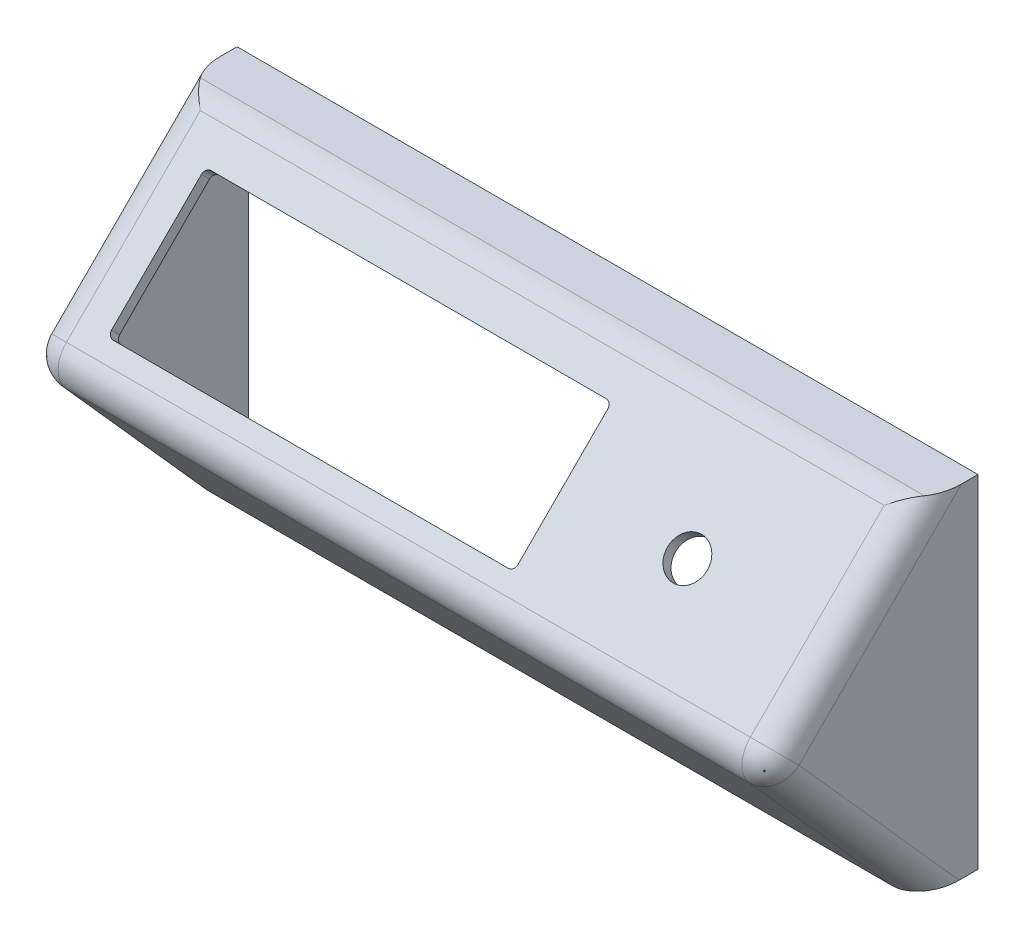
ISO-10303-21;
HEADER;
FILE_DESCRIPTION(('STEP AP214'),'2;1');
FILE_NAME('part.step','',(''),(''),'','','');
FILE_SCHEMA(('AUTOMOTIVE_DESIGN { 1 0 10303 214 1 1 1 1 }'));
ENDSEC;
DATA;
#1=APPLICATION_CONTEXT('core data for automotive mechanical design processes');
#2=APPLICATION_PROTOCOL_DEFINITION('international standard','automotive_design',2000,#1);
#3=PRODUCT_CONTEXT('',#1,'mechanical');
#4=PRODUCT('Part','Part','',(#3));
#5=PRODUCT_RELATED_PRODUCT_CATEGORY('part','',(#4));
#6=PRODUCT_DEFINITION_FORMATION('','',#4);
#7=PRODUCT_DEFINITION_CONTEXT('part definition',#1,'design');
#8=PRODUCT_DEFINITION('design','',#6,#7);
#9=PRODUCT_DEFINITION_SHAPE('','',#8);
#10=(LENGTH_UNIT() NAMED_UNIT(*) SI_UNIT(.MILLI.,.METRE.));
#11=(NAMED_UNIT(*) PLANE_ANGLE_UNIT() SI_UNIT($,.RADIAN.));
#12=(NAMED_UNIT(*) SI_UNIT($,.STERADIAN.) SOLID_ANGLE_UNIT());
#13=UNCERTAINTY_MEASURE_WITH_UNIT(LENGTH_MEASURE(1.E-05),#10,'distance_accuracy_value','');
#14=(GEOMETRIC_REPRESENTATION_CONTEXT(3) GLOBAL_UNCERTAINTY_ASSIGNED_CONTEXT((#13)) GLOBAL_UNIT_ASSIGNED_CONTEXT((#10,
#11,#12)) REPRESENTATION_CONTEXT('',''));
#15=CARTESIAN_POINT('',(0.,0.,0.));
#16=DIRECTION('',(0.,0.,1.));
#17=DIRECTION('',(1.,0.,0.));
#18=AXIS2_PLACEMENT_3D('',#15,#16,#17);
#19=CARTESIAN_POINT('',(65.,60.,-9.99999999999999));
#20=DIRECTION('',(0.,0.,1.));
#21=DIRECTION('',(0.,-1.,0.));
#22=AXIS2_PLACEMENT_3D('',#19,#20,#21);
#23=PLANE('',#22);
#24=DIRECTION('',(0.,1.,0.));
#25=VECTOR('',#24,1.);
#26=CARTESIAN_POINT('',(-65.,60.,-9.99999999999999));
#27=LINE('',#26,#25);
#28=CARTESIAN_POINT('',(-65.,0.,-10.));
#29=VERTEX_POINT('',#28);
#30=CARTESIAN_POINT('',(-65.,60.,-9.99999999999999));
#31=VERTEX_POINT('',#30);
#32=EDGE_CURVE('E295',#29,#31,#27,.T.);
#33=ORIENTED_EDGE('',*,*,#32,.T.);
#34=DIRECTION('',(-1.,0.,0.));
#35=VECTOR('',#34,1.);
#36=CARTESIAN_POINT('',(65.,60.,-9.99999999999999));
#37=LINE('',#36,#35);
#38=CARTESIAN_POINT('',(65.,60.,-9.99999999999999));
#39=VERTEX_POINT('',#38);
#40=EDGE_CURVE('E300',#39,#31,#37,.T.);
#41=ORIENTED_EDGE('',*,*,#40,.F.);
#42=DIRECTION('',(0.,1.,0.));
#43=VECTOR('',#42,1.);
#44=CARTESIAN_POINT('',(65.,60.,-9.99999999999999));
#45=LINE('',#44,#43);
#46=CARTESIAN_POINT('',(65.,0.,-10.));
#47=VERTEX_POINT('',#46);
#48=EDGE_CURVE('E287',#47,#39,#45,.T.);
#49=ORIENTED_EDGE('',*,*,#48,.F.);
#50=DIRECTION('',(-1.,0.,0.));
#51=VECTOR('',#50,1.);
#52=CARTESIAN_POINT('',(65.,0.,-10.));
#53=LINE('',#52,#51);
#54=EDGE_CURVE('E303',#47,#29,#53,.T.);
#55=ORIENTED_EDGE('',*,*,#54,.T.);
#56=EDGE_LOOP('',(#33,#41,#49,#55));
#57=FACE_BOUND('',#56,.T.);
#58=DIRECTION('',(0.,1.,0.));
#59=VECTOR('',#58,1.);
#60=CARTESIAN_POINT('',(-63.,0.,-10.));
#61=LINE('',#60,#59);
#62=CARTESIAN_POINT('',(-63.,2.,-10.));
#63=VERTEX_POINT('',#62);
#64=CARTESIAN_POINT('',(-63.,58.,-9.99999999999999));
#65=VERTEX_POINT('',#64);
#66=EDGE_CURVE('E251',#63,#65,#61,.T.);
#67=ORIENTED_EDGE('',*,*,#66,.F.);
#68=DIRECTION('',(-1.,0.,0.));
#69=VECTOR('',#68,1.);
#70=CARTESIAN_POINT('',(65.,2.,-10.));
#71=LINE('',#70,#69);
#72=CARTESIAN_POINT('',(63.,2.,-10.));
#73=VERTEX_POINT('',#72);
#74=EDGE_CURVE('E277',#73,#63,#71,.T.);
#75=ORIENTED_EDGE('',*,*,#74,.F.);
#76=DIRECTION('',(0.,1.,0.));
#77=VECTOR('',#76,1.);
#78=CARTESIAN_POINT('',(63.,0.,-10.));
#79=LINE('',#78,#77);
#80=CARTESIAN_POINT('',(63.,58.,-9.99999999999999));
#81=VERTEX_POINT('',#80);
#82=EDGE_CURVE('E254',#73,#81,#79,.T.);
#83=ORIENTED_EDGE('',*,*,#82,.T.);
#84=DIRECTION('',(-1.,0.,0.));
#85=VECTOR('',#84,1.);
#86=CARTESIAN_POINT('',(65.,58.,-9.99999999999999));
#87=LINE('',#86,#85);
#88=EDGE_CURVE('E274',#81,#65,#87,.T.);
#89=ORIENTED_EDGE('',*,*,#88,.T.);
#90=EDGE_LOOP('',(#67,#75,#83,#89));
#91=FACE_BOUND('',#90,.T.);
#92=ADVANCED_FACE('F36',(#57,#91),#23,.F.);
#93=CARTESIAN_POINT('',(65.,0.,0.));
#94=DIRECTION('',(0.,1.,0.));
#95=DIRECTION('',(0.,0.,1.));
#96=AXIS2_PLACEMENT_3D('',#93,#94,#95);
#97=PLANE('',#96);
#98=DIRECTION('',(0.,0.,-1.));
#99=VECTOR('',#98,1.);
#100=CARTESIAN_POINT('',(65.,0.,0.));
#101=LINE('',#100,#99);
#102=CARTESIAN_POINT('',(65.,0.,-6.69947312688053));
#103=VERTEX_POINT('',#102);
#104=EDGE_CURVE('E285',#103,#47,#101,.T.);
#105=ORIENTED_EDGE('',*,*,#104,.F.);
#106=CARTESIAN_POINT('',(60.,0.,-6.69947312688053));
#107=DIRECTION('',(0.,1.,0.));
#108=DIRECTION('',(0.,0.,-1.));
#109=AXIS2_PLACEMENT_3D('',#106,#107,#108);
#110=ELLIPSE('',#109,6.69947312688053,5.);
#111=CARTESIAN_POINT('',(60.,0.,0.));
#112=VERTEX_POINT('',#111);
#113=EDGE_CURVE('E328',#103,#112,#110,.F.);
#114=ORIENTED_EDGE('',*,*,#113,.T.);
#115=DIRECTION('',(-1.,0.,0.));
#116=VECTOR('',#115,1.);
#117=CARTESIAN_POINT('',(65.,0.,0.));
#118=LINE('',#117,#116);
#119=CARTESIAN_POINT('',(-60.,0.,0.));
#120=VERTEX_POINT('',#119);
#121=EDGE_CURVE('E293',#112,#120,#118,.T.);
#122=ORIENTED_EDGE('',*,*,#121,.T.);
#123=CARTESIAN_POINT('',(-60.,0.,-6.69947312688053));
#124=DIRECTION('',(0.,1.,0.));
#125=DIRECTION('',(0.,0.,1.));
#126=AXIS2_PLACEMENT_3D('',#123,#124,#125);
#127=ELLIPSE('',#126,6.69947312688053,5.);
#128=CARTESIAN_POINT('',(-65.,0.,-6.69947312688053));
#129=VERTEX_POINT('',#128);
#130=EDGE_CURVE('E326',#120,#129,#127,.F.);
#131=ORIENTED_EDGE('',*,*,#130,.T.);
#132=DIRECTION('',(0.,0.,-1.));
#133=VECTOR('',#132,1.);
#134=CARTESIAN_POINT('',(-65.,0.,0.));
#135=LINE('',#134,#133);
#136=EDGE_CURVE('E279',#129,#29,#135,.T.);
#137=ORIENTED_EDGE('',*,*,#136,.T.);
#138=ORIENTED_EDGE('',*,*,#54,.F.);
#139=EDGE_LOOP('',(#105,#114,#122,#131,#137,#138));
#140=FACE_BOUND('',#139,.T.);
#141=ADVANCED_FACE('F425',(#140),#97,.F.);
#142=CARTESIAN_POINT('',(65.,60.,0.));
#143=DIRECTION('',(0.,-1.,0.));
#144=DIRECTION('',(0.,0.,-1.));
#145=AXIS2_PLACEMENT_3D('',#142,#143,#144);
#146=PLANE('',#145);
#147=DIRECTION('',(0.,0.,1.));
#148=VECTOR('',#147,1.);
#149=CARTESIAN_POINT('',(-65.,60.,0.));
#150=LINE('',#149,#148);
#151=CARTESIAN_POINT('',(-65.,60.,-7.07106781186543));
#152=VERTEX_POINT('',#151);
#153=EDGE_CURVE('E288',#31,#152,#150,.T.);
#154=ORIENTED_EDGE('',*,*,#153,.T.);
#155=CARTESIAN_POINT('',(-60.,60.,-7.07106781186543));
#156=DIRECTION('',(0.,-1.,0.));
#157=DIRECTION('',(0.,0.,-1.));
#158=AXIS2_PLACEMENT_3D('',#155,#156,#157);
#159=ELLIPSE('',#158,7.07106781186544,5.);
#160=CARTESIAN_POINT('',(-63.5355339059328,60.,-2.07106781186549));
#161=VERTEX_POINT('',#160);
#162=EDGE_CURVE('E59',#152,#161,#159,.F.);
#163=ORIENTED_EDGE('',*,*,#162,.T.);
#164=DIRECTION('',(-1.,0.,0.));
#165=VECTOR('',#164,1.);
#166=CARTESIAN_POINT('',(65.,60.,-2.07106781186549));
#167=LINE('',#166,#165);
#168=CARTESIAN_POINT('',(63.5355339059328,60.,-2.07106781186549));
#169=VERTEX_POINT('',#168);
#170=EDGE_CURVE('E347',#161,#169,#167,.F.);
#171=ORIENTED_EDGE('',*,*,#170,.T.);
#172=CARTESIAN_POINT('',(60.,60.,-7.07106781186543));
#173=DIRECTION('',(0.,-1.,0.));
#174=DIRECTION('',(0.,0.,1.));
#175=AXIS2_PLACEMENT_3D('',#172,#173,#174);
#176=ELLIPSE('',#175,7.07106781186544,5.);
#177=CARTESIAN_POINT('',(65.,60.,-7.07106781186543));
#178=VERTEX_POINT('',#177);
#179=EDGE_CURVE('E345',#169,#178,#176,.F.);
#180=ORIENTED_EDGE('',*,*,#179,.T.);
#181=DIRECTION('',(0.,0.,1.));
#182=VECTOR('',#181,1.);
#183=CARTESIAN_POINT('',(65.,60.,0.));
#184=LINE('',#183,#182);
#185=EDGE_CURVE('E290',#39,#178,#184,.T.);
#186=ORIENTED_EDGE('',*,*,#185,.F.);
#187=ORIENTED_EDGE('',*,*,#40,.T.);
#188=EDGE_LOOP('',(#154,#163,#171,#180,#186,#187));
#189=FACE_BOUND('',#188,.T.);
#190=ADVANCED_FACE('F431',(#189),#146,.F.);
#191=CARTESIAN_POINT('',(65.,60.,0.));
#192=DIRECTION('',(0.,-0.707106781186544,-0.707106781186551));
#193=DIRECTION('',(0.,0.707106781186551,-0.707106781186544));
#194=AXIS2_PLACEMENT_3D('',#191,#192,#193);
#195=PLANE('',#194);
#196=CARTESIAN_POINT('',(38.15,45.857864376269,14.1421356237309));
#197=DIRECTION('',(0.,0.707106781186544,0.707106781186551));
#198=DIRECTION('',(0.,-0.707106781186551,0.707106781186544));
#199=AXIS2_PLACEMENT_3D('',#196,#197,#198);
#200=CIRCLE('',#199,3.5);
#201=CARTESIAN_POINT('',(38.15,43.382990642116,16.6170093578838));
#202=VERTEX_POINT('',#201);
#203=EDGE_CURVE('E377',#202,#202,#200,.T.);
#204=ORIENTED_EDGE('',*,*,#203,.F.);
#205=EDGE_LOOP('',(#204));
#206=FACE_BOUND('',#205,.T.);
#207=DIRECTION('',(0.,-0.707106781186551,0.707106781186544));
#208=VECTOR('',#207,1.);
#209=CARTESIAN_POINT('',(60.,60.,0.));
#210=LINE('',#209,#208);
#211=CARTESIAN_POINT('',(60.,35.0548393878896,24.9451606121102));
#212=VERTEX_POINT('',#211);
#213=CARTESIAN_POINT('',(60.,58.5355339059327,1.46446609406727));
#214=VERTEX_POINT('',#213);
#215=EDGE_CURVE('E338',#212,#214,#210,.F.);
#216=ORIENTED_EDGE('',*,*,#215,.T.);
#217=DIRECTION('',(-1.,0.,0.));
#218=VECTOR('',#217,1.);
#219=CARTESIAN_POINT('',(65.,58.5355339059327,1.46446609406727));
#220=LINE('',#219,#218);
#221=CARTESIAN_POINT('',(-60.,58.5355339059327,1.46446609406727));
#222=VERTEX_POINT('',#221);
#223=EDGE_CURVE('E342',#214,#222,#220,.T.);
#224=ORIENTED_EDGE('',*,*,#223,.T.);
#225=DIRECTION('',(0.,-0.707106781186551,0.707106781186544));
#226=VECTOR('',#225,1.);
#227=CARTESIAN_POINT('',(-60.,31.7157287525379,28.2842712474617));
#228=LINE('',#227,#226);
#229=CARTESIAN_POINT('',(-60.,35.0548393878896,24.9451606121102));
#230=VERTEX_POINT('',#229);
#231=EDGE_CURVE('E340',#222,#230,#228,.T.);
#232=ORIENTED_EDGE('',*,*,#231,.T.);
#233=DIRECTION('',(-1.,0.,0.));
#234=VECTOR('',#233,1.);
#235=CARTESIAN_POINT('',(65.,35.0548393878896,24.9451606121102));
#236=LINE('',#235,#234);
#237=EDGE_CURVE('E336',#230,#212,#236,.F.);
#238=ORIENTED_EDGE('',*,*,#237,.T.);
#239=EDGE_LOOP('',(#216,#224,#232,#238));
#240=FACE_BOUND('',#239,.T.);
#241=DIRECTION('',(-1.,0.,0.));
#242=VECTOR('',#241,1.);
#243=CARTESIAN_POINT('',(15.3,54.4492117676856,5.55078823231435));
#244=LINE('',#243,#242);
#245=CARTESIAN_POINT('',(15.3,54.4492117676856,5.55078823231436));
#246=VERTEX_POINT('',#245);
#247=CARTESIAN_POINT('',(-54.,54.4492117676856,5.55078823231436));
#248=VERTEX_POINT('',#247);
#249=EDGE_CURVE('E209',#246,#248,#244,.T.);
#250=ORIENTED_EDGE('',*,*,#249,.F.);
#251=CARTESIAN_POINT('',(15.3,53.742104986499,6.2578950135009));
#252=DIRECTION('',(0.,0.707106781186544,0.707106781186551));
#253=DIRECTION('',(0.,-0.707106781186551,0.707106781186544));
#254=AXIS2_PLACEMENT_3D('',#251,#252,#253);
#255=CIRCLE('',#254,1.00000000000001);
#256=CARTESIAN_POINT('',(16.3,53.742104986499,6.2578950135009));
#257=VERTEX_POINT('',#256);
#258=EDGE_CURVE('E214',#257,#246,#255,.T.);
#259=ORIENTED_EDGE('',*,*,#258,.F.);
#260=DIRECTION('',(0.,0.707106781186551,-0.707106781186544));
#261=VECTOR('',#260,1.);
#262=CARTESIAN_POINT('',(16.3,37.9736237660389,22.0263762339608));
#263=LINE('',#262,#261);
#264=CARTESIAN_POINT('',(16.3,37.9736237660389,22.0263762339608));
#265=VERTEX_POINT('',#264);
#266=EDGE_CURVE('E233',#265,#257,#263,.T.);
#267=ORIENTED_EDGE('',*,*,#266,.F.);
#268=CARTESIAN_POINT('',(15.3,37.9736237660389,22.0263762339608));
#269=DIRECTION('',(0.,0.707106781186544,0.707106781186551));
#270=DIRECTION('',(0.,-0.707106781186551,0.707106781186544));
#271=AXIS2_PLACEMENT_3D('',#268,#269,#270);
#272=CIRCLE('',#271,1.);
#273=CARTESIAN_POINT('',(15.3,37.2665169848524,22.7334830151474));
#274=VERTEX_POINT('',#273);
#275=EDGE_CURVE('E230',#274,#265,#272,.T.);
#276=ORIENTED_EDGE('',*,*,#275,.F.);
#277=DIRECTION('',(1.,0.,0.));
#278=VECTOR('',#277,1.);
#279=CARTESIAN_POINT('',(15.3,37.2665169848524,22.7334830151474));
#280=LINE('',#279,#278);
#281=CARTESIAN_POINT('',(-54.,37.2665169848524,22.7334830151474));
#282=VERTEX_POINT('',#281);
#283=EDGE_CURVE('E227',#282,#274,#280,.T.);
#284=ORIENTED_EDGE('',*,*,#283,.F.);
#285=CARTESIAN_POINT('',(-54.,37.9736237660389,22.0263762339608));
#286=DIRECTION('',(0.,0.707106781186544,0.707106781186551));
#287=DIRECTION('',(0.,0.707106781186551,-0.707106781186544));
#288=AXIS2_PLACEMENT_3D('',#285,#286,#287);
#289=CIRCLE('',#288,1.);
#290=CARTESIAN_POINT('',(-55.,37.9736237660389,22.0263762339608));
#291=VERTEX_POINT('',#290);
#292=EDGE_CURVE('E221',#291,#282,#289,.T.);
#293=ORIENTED_EDGE('',*,*,#292,.F.);
#294=DIRECTION('',(0.,-0.707106781186551,0.707106781186544));
#295=VECTOR('',#294,1.);
#296=CARTESIAN_POINT('',(-55.,37.9736237660389,22.0263762339608));
#297=LINE('',#296,#295);
#298=CARTESIAN_POINT('',(-55.,53.742104986499,6.2578950135009));
#299=VERTEX_POINT('',#298);
#300=EDGE_CURVE('E219',#299,#291,#297,.T.);
#301=ORIENTED_EDGE('',*,*,#300,.F.);
#302=CARTESIAN_POINT('',(-54.,53.742104986499,6.2578950135009));
#303=DIRECTION('',(0.,0.707106781186544,0.707106781186551));
#304=DIRECTION('',(0.,-0.707106781186551,0.707106781186544));
#305=AXIS2_PLACEMENT_3D('',#302,#303,#304);
#306=CIRCLE('',#305,1.);
#307=EDGE_CURVE('E198',#248,#299,#306,.T.);
#308=ORIENTED_EDGE('',*,*,#307,.F.);
#309=EDGE_LOOP('',(#250,#259,#267,#276,#284,#293,#301,#308));
#310=FACE_BOUND('',#309,.T.);
#311=ADVANCED_FACE('F216',(#206,#240,#310),#195,.F.);
#312=CARTESIAN_POINT('',(65.,31.7157287525379,28.2842712474618));
#313=DIRECTION('',(0.,0.665579065365146,-0.746327346241352));
#314=DIRECTION('',(0.,0.746327346241352,0.665579065365146));
#315=AXIS2_PLACEMENT_3D('',#312,#313,#314);
#316=PLANE('',#315);
#317=ORIENTED_EDGE('',*,*,#121,.F.);
#318=DIRECTION('',(0.,-0.746327346241352,-0.665579065365146));
#319=VECTOR('',#318,1.);
#320=CARTESIAN_POINT('',(60.,31.7157287525379,28.2842712474618));
#321=LINE('',#320,#319);
#322=CARTESIAN_POINT('',(60.,28.1914101551311,25.1412634373842));
#323=VERTEX_POINT('',#322);
#324=EDGE_CURVE('E334',#112,#323,#321,.F.);
#325=ORIENTED_EDGE('',*,*,#324,.T.);
#326=DIRECTION('',(-1.,0.,0.));
#327=VECTOR('',#326,1.);
#328=CARTESIAN_POINT('',(65.,28.1914101551311,25.1412634373842));
#329=LINE('',#328,#327);
#330=CARTESIAN_POINT('',(-60.,28.1914101551311,25.1412634373842));
#331=VERTEX_POINT('',#330);
#332=EDGE_CURVE('E330',#323,#331,#329,.T.);
#333=ORIENTED_EDGE('',*,*,#332,.T.);
#334=DIRECTION('',(0.,-0.746327346241352,-0.665579065365146));
#335=VECTOR('',#334,1.);
#336=CARTESIAN_POINT('',(-60.,0.,0.));
#337=LINE('',#336,#335);
#338=EDGE_CURVE('E332',#331,#120,#337,.T.);
#339=ORIENTED_EDGE('',*,*,#338,.T.);
#340=EDGE_LOOP('',(#317,#325,#333,#339));
#341=FACE_BOUND('',#340,.T.);
#342=ADVANCED_FACE('F496',(#341),#316,.F.);
#343=CARTESIAN_POINT('',(65.,0.,0.));
#344=DIRECTION('',(-1.,0.,0.));
#345=DIRECTION('',(0.,0.,1.));
#346=AXIS2_PLACEMENT_3D('',#343,#344,#345);
#347=PLANE('',#346);
#348=DIRECTION('',(0.,-0.707106781186551,0.707106781186544));
#349=VECTOR('',#348,1.);
#350=CARTESIAN_POINT('',(65.,26.464466094067,26.4644660940672));
#351=LINE('',#350,#349);
#352=CARTESIAN_POINT('',(65.,31.5193054819568,21.4096267061774));
#353=VERTEX_POINT('',#352);
#354=EDGE_CURVE('E321',#178,#353,#351,.T.);
#355=ORIENTED_EDGE('',*,*,#354,.T.);
#356=DIRECTION('',(0.,-0.746327346241352,-0.665579065365146));
#357=VECTOR('',#356,1.);
#358=CARTESIAN_POINT('',(65.,3.32789532682573,-3.73163673120676));
#359=LINE('',#358,#357);
#360=EDGE_CURVE('E323',#353,#103,#359,.T.);
#361=ORIENTED_EDGE('',*,*,#360,.T.);
#362=ORIENTED_EDGE('',*,*,#104,.T.);
#363=ORIENTED_EDGE('',*,*,#48,.T.);
#364=ORIENTED_EDGE('',*,*,#185,.T.);
#365=EDGE_LOOP('',(#355,#361,#362,#363,#364));
#366=FACE_BOUND('',#365,.T.);
#367=ADVANCED_FACE('F475',(#366),#347,.F.);
#368=CARTESIAN_POINT('',(-65.,0.,0.));
#369=DIRECTION('',(-1.,0.,0.));
#370=DIRECTION('',(0.,0.,1.));
#371=AXIS2_PLACEMENT_3D('',#368,#369,#370);
#372=PLANE('',#371);
#373=ORIENTED_EDGE('',*,*,#136,.F.);
#374=DIRECTION('',(0.,-0.746327346241352,-0.665579065365146));
#375=VECTOR('',#374,1.);
#376=CARTESIAN_POINT('',(-65.,35.0436240793637,24.552634516255));
#377=LINE('',#376,#375);
#378=CARTESIAN_POINT('',(-65.,31.5193054819568,21.4096267061774));
#379=VERTEX_POINT('',#378);
#380=EDGE_CURVE('E11',#129,#379,#377,.F.);
#381=ORIENTED_EDGE('',*,*,#380,.T.);
#382=DIRECTION('',(0.,-0.707106781186551,0.707106781186544));
#383=VECTOR('',#382,1.);
#384=CARTESIAN_POINT('',(-65.,56.4644660940673,-3.53553390593275));
#385=LINE('',#384,#383);
#386=EDGE_CURVE('E45',#379,#152,#385,.F.);
#387=ORIENTED_EDGE('',*,*,#386,.T.);
#388=ORIENTED_EDGE('',*,*,#153,.F.);
#389=ORIENTED_EDGE('',*,*,#32,.F.);
#390=EDGE_LOOP('',(#373,#381,#387,#388,#389));
#391=FACE_BOUND('',#390,.T.);
#392=ADVANCED_FACE('F489',(#391),#372,.T.);
#393=CARTESIAN_POINT('',(65.,2.,0.));
#394=DIRECTION('',(0.,1.,0.));
#395=DIRECTION('',(0.,0.,1.));
#396=AXIS2_PLACEMENT_3D('',#393,#394,#395);
#397=PLANE('',#396);
#398=DIRECTION('',(0.,0.,-1.));
#399=VECTOR('',#398,1.);
#400=CARTESIAN_POINT('',(-63.,2.,0.));
#401=LINE('',#400,#399);
#402=CARTESIAN_POINT('',(-63.,2.,-0.896177625860988));
#403=VERTEX_POINT('',#402);
#404=EDGE_CURVE('E238',#403,#63,#401,.T.);
#405=ORIENTED_EDGE('',*,*,#404,.F.);
#406=DIRECTION('',(-1.,0.,0.));
#407=VECTOR('',#406,1.);
#408=CARTESIAN_POINT('',(65.,2.,-0.896177625860986));
#409=LINE('',#408,#407);
#410=CARTESIAN_POINT('',(63.,2.,-0.896177625860988));
#411=VERTEX_POINT('',#410);
#412=EDGE_CURVE('E256',#411,#403,#409,.T.);
#413=ORIENTED_EDGE('',*,*,#412,.F.);
#414=DIRECTION('',(0.,0.,-1.));
#415=VECTOR('',#414,1.);
#416=CARTESIAN_POINT('',(63.,2.,0.));
#417=LINE('',#416,#415);
#418=EDGE_CURVE('E252',#411,#73,#417,.T.);
#419=ORIENTED_EDGE('',*,*,#418,.T.);
#420=ORIENTED_EDGE('',*,*,#74,.T.);
#421=EDGE_LOOP('',(#405,#413,#419,#420));
#422=FACE_BOUND('',#421,.T.);
#423=ADVANCED_FACE('F415',(#422),#397,.T.);
#424=CARTESIAN_POINT('',(65.,58.,0.));
#425=DIRECTION('',(0.,-1.,0.));
#426=DIRECTION('',(0.,0.,-1.));
#427=AXIS2_PLACEMENT_3D('',#424,#425,#426);
#428=PLANE('',#427);
#429=DIRECTION('',(0.,0.,1.));
#430=VECTOR('',#429,1.);
#431=CARTESIAN_POINT('',(-63.,58.,0.));
#432=LINE('',#431,#430);
#433=CARTESIAN_POINT('',(-63.,58.,-0.828427124746191));
#434=VERTEX_POINT('',#433);
#435=EDGE_CURVE('E269',#65,#434,#432,.T.);
#436=ORIENTED_EDGE('',*,*,#435,.F.);
#437=ORIENTED_EDGE('',*,*,#88,.F.);
#438=DIRECTION('',(0.,0.,1.));
#439=VECTOR('',#438,1.);
#440=CARTESIAN_POINT('',(63.,58.,0.));
#441=LINE('',#440,#439);
#442=CARTESIAN_POINT('',(63.,58.,-0.828427124746191));
#443=VERTEX_POINT('',#442);
#444=EDGE_CURVE('E271',#81,#443,#441,.T.);
#445=ORIENTED_EDGE('',*,*,#444,.T.);
#446=DIRECTION('',(-1.,0.,0.));
#447=VECTOR('',#446,1.);
#448=CARTESIAN_POINT('',(65.,58.,-0.828427124746191));
#449=LINE('',#448,#447);
#450=EDGE_CURVE('E267',#443,#434,#449,.T.);
#451=ORIENTED_EDGE('',*,*,#450,.T.);
#452=EDGE_LOOP('',(#436,#437,#445,#451));
#453=FACE_BOUND('',#452,.T.);
#454=ADVANCED_FACE('F390',(#453),#428,.T.);
#455=CARTESIAN_POINT('',(65.,58.5857864376269,-1.4142135623731));
#456=DIRECTION('',(0.,-0.707106781186544,-0.707106781186551));
#457=DIRECTION('',(0.,0.707106781186551,-0.707106781186544));
#458=AXIS2_PLACEMENT_3D('',#455,#456,#457);
#459=PLANE('',#458);
#460=CARTESIAN_POINT('',(38.15,44.4436508138959,12.7279220613578));
#461=DIRECTION('',(0.,-0.707106781186544,-0.707106781186551));
#462=DIRECTION('',(0.,0.707106781186551,-0.707106781186544));
#463=AXIS2_PLACEMENT_3D('',#460,#461,#462);
#464=CIRCLE('',#463,3.5);
#465=CARTESIAN_POINT('',(38.15,46.9185245480488,10.2530483272049));
#466=VERTEX_POINT('',#465);
#467=EDGE_CURVE('E40',#466,#466,#464,.T.);
#468=ORIENTED_EDGE('',*,*,#467,.F.);
#469=EDGE_LOOP('',(#468));
#470=FACE_BOUND('',#469,.T.);
#471=CARTESIAN_POINT('',(15.3,52.3278914241259,4.8436814511278));
#472=DIRECTION('',(0.,-0.707106781186544,-0.707106781186551));
#473=DIRECTION('',(0.,0.707106781186551,-0.707106781186544));
#474=AXIS2_PLACEMENT_3D('',#471,#472,#473);
#475=CIRCLE('',#474,1.00000000000001);
#476=CARTESIAN_POINT('',(15.3,53.0349982053125,4.13657466994125));
#477=VERTEX_POINT('',#476);
#478=CARTESIAN_POINT('',(16.3,52.3278914241259,4.8436814511278));
#479=VERTEX_POINT('',#478);
#480=EDGE_CURVE('E319',#477,#479,#475,.T.);
#481=ORIENTED_EDGE('',*,*,#480,.F.);
#482=DIRECTION('',(1.,0.,0.));
#483=VECTOR('',#482,1.);
#484=CARTESIAN_POINT('',(65.,53.0349982053125,4.13657466994124));
#485=LINE('',#484,#483);
#486=CARTESIAN_POINT('',(-54.,53.0349982053125,4.13657466994126));
#487=VERTEX_POINT('',#486);
#488=EDGE_CURVE('E306',#487,#477,#485,.T.);
#489=ORIENTED_EDGE('',*,*,#488,.F.);
#490=CARTESIAN_POINT('',(-54.,52.3278914241259,4.8436814511278));
#491=DIRECTION('',(0.,-0.707106781186544,-0.707106781186551));
#492=DIRECTION('',(0.,0.707106781186551,-0.707106781186544));
#493=AXIS2_PLACEMENT_3D('',#490,#491,#492);
#494=CIRCLE('',#493,1.);
#495=CARTESIAN_POINT('',(-55.,52.3278914241259,4.8436814511278));
#496=VERTEX_POINT('',#495);
#497=EDGE_CURVE('E201',#496,#487,#494,.T.);
#498=ORIENTED_EDGE('',*,*,#497,.F.);
#499=DIRECTION('',(0.,0.707106781186551,-0.707106781186544));
#500=VECTOR('',#499,1.);
#501=CARTESIAN_POINT('',(-55.,58.5857864376269,-1.4142135623731));
#502=LINE('',#501,#500);
#503=CARTESIAN_POINT('',(-55.,36.5594102036658,20.6121626715877));
#504=VERTEX_POINT('',#503);
#505=EDGE_CURVE('E309',#504,#496,#502,.T.);
#506=ORIENTED_EDGE('',*,*,#505,.F.);
#507=CARTESIAN_POINT('',(-54.,36.5594102036658,20.6121626715877));
#508=DIRECTION('',(0.,-0.707106781186544,-0.707106781186551));
#509=DIRECTION('',(0.,0.707106781186551,-0.707106781186544));
#510=AXIS2_PLACEMENT_3D('',#507,#508,#509);
#511=CIRCLE('',#510,1.);
#512=CARTESIAN_POINT('',(-54.,35.8523034224793,21.3192694527743));
#513=VERTEX_POINT('',#512);
#514=EDGE_CURVE('E311',#513,#504,#511,.T.);
#515=ORIENTED_EDGE('',*,*,#514,.F.);
#516=DIRECTION('',(-1.,0.,0.));
#517=VECTOR('',#516,1.);
#518=CARTESIAN_POINT('',(65.,35.8523034224793,21.3192694527743));
#519=LINE('',#518,#517);
#520=CARTESIAN_POINT('',(15.3,35.8523034224793,21.3192694527743));
#521=VERTEX_POINT('',#520);
#522=EDGE_CURVE('E313',#521,#513,#519,.T.);
#523=ORIENTED_EDGE('',*,*,#522,.F.);
#524=CARTESIAN_POINT('',(15.3,36.5594102036658,20.6121626715877));
#525=DIRECTION('',(0.,-0.707106781186544,-0.707106781186551));
#526=DIRECTION('',(0.,0.707106781186551,-0.707106781186544));
#527=AXIS2_PLACEMENT_3D('',#524,#525,#526);
#528=CIRCLE('',#527,1.);
#529=CARTESIAN_POINT('',(16.3,36.5594102036658,20.6121626715877));
#530=VERTEX_POINT('',#529);
#531=EDGE_CURVE('E315',#530,#521,#528,.T.);
#532=ORIENTED_EDGE('',*,*,#531,.F.);
#533=DIRECTION('',(0.,-0.707106781186551,0.707106781186544));
#534=VECTOR('',#533,1.);
#535=CARTESIAN_POINT('',(16.3,58.5857864376269,-1.4142135623731));
#536=LINE('',#535,#534);
#537=EDGE_CURVE('E317',#479,#530,#536,.T.);
#538=ORIENTED_EDGE('',*,*,#537,.F.);
#539=EDGE_LOOP('',(#481,#489,#498,#506,#515,#523,#532,#538));
#540=FACE_BOUND('',#539,.T.);
#541=DIRECTION('',(0.,-0.707106781186551,0.707106781186544));
#542=VECTOR('',#541,1.);
#543=CARTESIAN_POINT('',(-63.,28.5857864376266,28.5857864376269));
#544=LINE('',#543,#542);
#545=CARTESIAN_POINT('',(-63.,31.6371594443055,25.534413430948));
#546=VERTEX_POINT('',#545);
#547=EDGE_CURVE('E262',#434,#546,#544,.T.);
#548=ORIENTED_EDGE('',*,*,#547,.F.);
#549=ORIENTED_EDGE('',*,*,#450,.F.);
#550=DIRECTION('',(0.,-0.707106781186551,0.707106781186544));
#551=VECTOR('',#550,1.);
#552=CARTESIAN_POINT('',(63.,28.5857864376266,28.5857864376269));
#553=LINE('',#552,#551);
#554=CARTESIAN_POINT('',(63.,31.6371594443055,25.534413430948));
#555=VERTEX_POINT('',#554);
#556=EDGE_CURVE('E264',#443,#555,#553,.T.);
#557=ORIENTED_EDGE('',*,*,#556,.T.);
#558=DIRECTION('',(-1.,0.,0.));
#559=VECTOR('',#558,1.);
#560=CARTESIAN_POINT('',(65.,31.6371594443055,25.534413430948));
#561=LINE('',#560,#559);
#562=EDGE_CURVE('E259',#555,#546,#561,.T.);
#563=ORIENTED_EDGE('',*,*,#562,.T.);
#564=EDGE_LOOP('',(#548,#549,#557,#563));
#565=FACE_BOUND('',#564,.T.);
#566=ADVANCED_FACE('F386',(#470,#540,#565),#459,.T.);
#567=CARTESIAN_POINT('',(65.,33.0468868832682,26.7916165549791));
#568=DIRECTION('',(0.,0.665579065365146,-0.746327346241352));
#569=DIRECTION('',(0.,0.746327346241352,0.665579065365146));
#570=AXIS2_PLACEMENT_3D('',#567,#568,#569);
#571=PLANE('',#570);
#572=DIRECTION('',(0.,-0.746327346241352,-0.665579065365146));
#573=VECTOR('',#572,1.);
#574=CARTESIAN_POINT('',(-63.,1.33115813073029,-1.4926546924827));
#575=LINE('',#574,#573);
#576=EDGE_CURVE('E255',#546,#403,#575,.T.);
#577=ORIENTED_EDGE('',*,*,#576,.F.);
#578=ORIENTED_EDGE('',*,*,#562,.F.);
#579=DIRECTION('',(0.,-0.746327346241352,-0.665579065365146));
#580=VECTOR('',#579,1.);
#581=CARTESIAN_POINT('',(63.,1.33115813073029,-1.4926546924827));
#582=LINE('',#581,#580);
#583=EDGE_CURVE('E260',#555,#411,#582,.T.);
#584=ORIENTED_EDGE('',*,*,#583,.T.);
#585=ORIENTED_EDGE('',*,*,#412,.T.);
#586=EDGE_LOOP('',(#577,#578,#584,#585));
#587=FACE_BOUND('',#586,.T.);
#588=ADVANCED_FACE('F389',(#587),#571,.T.);
#589=CARTESIAN_POINT('',(63.,0.,0.));
#590=DIRECTION('',(-1.,0.,0.));
#591=DIRECTION('',(0.,0.,1.));
#592=AXIS2_PLACEMENT_3D('',#589,#590,#591);
#593=PLANE('',#592);
#594=ORIENTED_EDGE('',*,*,#418,.F.);
#595=ORIENTED_EDGE('',*,*,#583,.F.);
#596=ORIENTED_EDGE('',*,*,#556,.F.);
#597=ORIENTED_EDGE('',*,*,#444,.F.);
#598=ORIENTED_EDGE('',*,*,#82,.F.);
#599=EDGE_LOOP('',(#594,#595,#596,#597,#598));
#600=FACE_BOUND('',#599,.T.);
#601=ADVANCED_FACE('F409',(#600),#593,.T.);
#602=CARTESIAN_POINT('',(-63.,0.,0.));
#603=DIRECTION('',(-1.,0.,0.));
#604=DIRECTION('',(0.,0.,1.));
#605=AXIS2_PLACEMENT_3D('',#602,#603,#604);
#606=PLANE('',#605);
#607=ORIENTED_EDGE('',*,*,#404,.T.);
#608=ORIENTED_EDGE('',*,*,#66,.T.);
#609=ORIENTED_EDGE('',*,*,#435,.T.);
#610=ORIENTED_EDGE('',*,*,#547,.T.);
#611=ORIENTED_EDGE('',*,*,#576,.T.);
#612=EDGE_LOOP('',(#607,#608,#609,#610,#611));
#613=FACE_BOUND('',#612,.T.);
#614=ADVANCED_FACE('F401',(#613),#606,.F.);
#615=CARTESIAN_POINT('',(15.3,-16.9685731321554,-64.4527831051542));
#616=DIRECTION('',(0.,0.707106781186544,0.707106781186551));
#617=DIRECTION('',(0.,-0.707106781186551,0.707106781186544));
#618=AXIS2_PLACEMENT_3D('',#615,#616,#617);
#619=CYLINDRICAL_SURFACE('',#618,1.00000000000001);
#620=ORIENTED_EDGE('',*,*,#480,.T.);
#621=DIRECTION('',(0.,0.707106781186544,0.707106781186551));
#622=VECTOR('',#621,1.);
#623=CARTESIAN_POINT('',(16.3,-16.9685731321554,-64.4527831051542));
#624=LINE('',#623,#622);
#625=EDGE_CURVE('E236',#479,#257,#624,.T.);
#626=ORIENTED_EDGE('',*,*,#625,.T.);
#627=ORIENTED_EDGE('',*,*,#258,.T.);
#628=DIRECTION('',(0.,0.707106781186544,0.707106781186551));
#629=VECTOR('',#628,1.);
#630=CARTESIAN_POINT('',(15.3,-16.2614663509688,-65.1598898863408));
#631=LINE('',#630,#629);
#632=EDGE_CURVE('E205',#477,#246,#631,.T.);
#633=ORIENTED_EDGE('',*,*,#632,.F.);
#634=EDGE_LOOP('',(#620,#626,#627,#633));
#635=FACE_BOUND('',#634,.T.);
#636=ADVANCED_FACE('F510',(#635),#619,.F.);
#637=CARTESIAN_POINT('',(16.3,-32.7370543526155,-48.6843018846943));
#638=DIRECTION('',(1.,0.,0.));
#639=DIRECTION('',(0.,0.,-1.));
#640=AXIS2_PLACEMENT_3D('',#637,#638,#639);
#641=PLANE('',#640);
#642=ORIENTED_EDGE('',*,*,#537,.T.);
#643=DIRECTION('',(0.,0.707106781186544,0.707106781186551));
#644=VECTOR('',#643,1.);
#645=CARTESIAN_POINT('',(16.3,-32.7370543526155,-48.6843018846943));
#646=LINE('',#645,#644);
#647=EDGE_CURVE('E239',#530,#265,#646,.T.);
#648=ORIENTED_EDGE('',*,*,#647,.T.);
#649=ORIENTED_EDGE('',*,*,#266,.T.);
#650=ORIENTED_EDGE('',*,*,#625,.F.);
#651=EDGE_LOOP('',(#642,#648,#649,#650));
#652=FACE_BOUND('',#651,.T.);
#653=ADVANCED_FACE('F514',(#652),#641,.F.);
#654=CARTESIAN_POINT('',(15.3,-32.7370543526155,-48.6843018846943));
#655=DIRECTION('',(0.,0.707106781186544,0.707106781186551));
#656=DIRECTION('',(0.,-0.707106781186551,0.707106781186544));
#657=AXIS2_PLACEMENT_3D('',#654,#655,#656);
#658=CYLINDRICAL_SURFACE('',#657,1.);
#659=ORIENTED_EDGE('',*,*,#531,.T.);
#660=DIRECTION('',(0.,0.707106781186544,0.707106781186551));
#661=VECTOR('',#660,1.);
#662=CARTESIAN_POINT('',(15.3,-33.444161133802,-47.9771951035078));
#663=LINE('',#662,#661);
#664=EDGE_CURVE('E241',#521,#274,#663,.T.);
#665=ORIENTED_EDGE('',*,*,#664,.T.);
#666=ORIENTED_EDGE('',*,*,#275,.T.);
#667=ORIENTED_EDGE('',*,*,#647,.F.);
#668=EDGE_LOOP('',(#659,#665,#666,#667));
#669=FACE_BOUND('',#668,.T.);
#670=ADVANCED_FACE('F519',(#669),#658,.F.);
#671=CARTESIAN_POINT('',(15.3,-33.444161133802,-47.9771951035078));
#672=DIRECTION('',(0.,-0.707106781186551,0.707106781186544));
#673=DIRECTION('',(0.,-0.707106781186544,-0.707106781186551));
#674=AXIS2_PLACEMENT_3D('',#671,#672,#673);
#675=PLANE('',#674);
#676=ORIENTED_EDGE('',*,*,#522,.T.);
#677=DIRECTION('',(0.,0.707106781186544,0.707106781186551));
#678=VECTOR('',#677,1.);
#679=CARTESIAN_POINT('',(-54.,-33.444161133802,-47.9771951035078));
#680=LINE('',#679,#678);
#681=EDGE_CURVE('E243',#513,#282,#680,.T.);
#682=ORIENTED_EDGE('',*,*,#681,.T.);
#683=ORIENTED_EDGE('',*,*,#283,.T.);
#684=ORIENTED_EDGE('',*,*,#664,.F.);
#685=EDGE_LOOP('',(#676,#682,#683,#684));
#686=FACE_BOUND('',#685,.T.);
#687=ADVANCED_FACE('F648',(#686),#675,.F.);
#688=CARTESIAN_POINT('',(-54.,-32.7370543526155,-48.6843018846943));
#689=DIRECTION('',(0.,0.707106781186544,0.707106781186551));
#690=DIRECTION('',(0.,-0.707106781186551,0.707106781186544));
#691=AXIS2_PLACEMENT_3D('',#688,#689,#690);
#692=CYLINDRICAL_SURFACE('',#691,1.);
#693=ORIENTED_EDGE('',*,*,#514,.T.);
#694=DIRECTION('',(0.,0.707106781186544,0.707106781186551));
#695=VECTOR('',#694,1.);
#696=CARTESIAN_POINT('',(-55.,-32.7370543526155,-48.6843018846943));
#697=LINE('',#696,#695);
#698=EDGE_CURVE('E245',#504,#291,#697,.T.);
#699=ORIENTED_EDGE('',*,*,#698,.T.);
#700=ORIENTED_EDGE('',*,*,#292,.T.);
#701=ORIENTED_EDGE('',*,*,#681,.F.);
#702=EDGE_LOOP('',(#693,#699,#700,#701));
#703=FACE_BOUND('',#702,.T.);
#704=ADVANCED_FACE('F638',(#703),#692,.F.);
#705=CARTESIAN_POINT('',(-55.,-32.7370543526155,-48.6843018846943));
#706=DIRECTION('',(-1.,0.,0.));
#707=DIRECTION('',(0.,0.,1.));
#708=AXIS2_PLACEMENT_3D('',#705,#706,#707);
#709=PLANE('',#708);
#710=ORIENTED_EDGE('',*,*,#505,.T.);
#711=DIRECTION('',(0.,0.707106781186544,0.707106781186551));
#712=VECTOR('',#711,1.);
#713=CARTESIAN_POINT('',(-55.,-16.9685731321554,-64.4527831051542));
#714=LINE('',#713,#712);
#715=EDGE_CURVE('E204',#496,#299,#714,.T.);
#716=ORIENTED_EDGE('',*,*,#715,.T.);
#717=ORIENTED_EDGE('',*,*,#300,.T.);
#718=ORIENTED_EDGE('',*,*,#698,.F.);
#719=EDGE_LOOP('',(#710,#716,#717,#718));
#720=FACE_BOUND('',#719,.T.);
#721=ADVANCED_FACE('F630',(#720),#709,.F.);
#722=CARTESIAN_POINT('',(-54.,-16.9685731321554,-64.4527831051542));
#723=DIRECTION('',(0.,0.707106781186544,0.707106781186551));
#724=DIRECTION('',(0.,-0.707106781186551,0.707106781186544));
#725=AXIS2_PLACEMENT_3D('',#722,#723,#724);
#726=CYLINDRICAL_SURFACE('',#725,1.);
#727=ORIENTED_EDGE('',*,*,#497,.T.);
#728=DIRECTION('',(0.,0.707106781186544,0.707106781186551));
#729=VECTOR('',#728,1.);
#730=CARTESIAN_POINT('',(-54.,-16.2614663509688,-65.1598898863408));
#731=LINE('',#730,#729);
#732=EDGE_CURVE('E193',#487,#248,#731,.T.);
#733=ORIENTED_EDGE('',*,*,#732,.T.);
#734=ORIENTED_EDGE('',*,*,#307,.T.);
#735=ORIENTED_EDGE('',*,*,#715,.F.);
#736=EDGE_LOOP('',(#727,#733,#734,#735));
#737=FACE_BOUND('',#736,.T.);
#738=ADVANCED_FACE('F195',(#737),#726,.F.);
#739=CARTESIAN_POINT('',(15.3,-16.2614663509688,-65.1598898863408));
#740=DIRECTION('',(0.,0.707106781186551,-0.707106781186544));
#741=DIRECTION('',(0.,0.707106781186544,0.707106781186551));
#742=AXIS2_PLACEMENT_3D('',#739,#740,#741);
#743=PLANE('',#742);
#744=ORIENTED_EDGE('',*,*,#488,.T.);
#745=ORIENTED_EDGE('',*,*,#632,.T.);
#746=ORIENTED_EDGE('',*,*,#249,.T.);
#747=ORIENTED_EDGE('',*,*,#732,.F.);
#748=EDGE_LOOP('',(#744,#745,#746,#747));
#749=FACE_BOUND('',#748,.T.);
#750=ADVANCED_FACE('F210',(#749),#743,.F.);
#751=CARTESIAN_POINT('',(-60.,35.0436240793637,24.552634516255));
#752=DIRECTION('',(0.,0.746327346241352,0.665579065365146));
#753=DIRECTION('',(0.,-0.665579065365146,0.746327346241352));
#754=AXIS2_PLACEMENT_3D('',#751,#752,#753);
#755=CYLINDRICAL_SURFACE('',#754,5.);
#756=ORIENTED_EDGE('',*,*,#130,.F.);
#757=ORIENTED_EDGE('',*,*,#338,.F.);
#758=CARTESIAN_POINT('',(-60.,31.5193054819568,21.4096267061774));
#759=DIRECTION('',(0.,0.746327346241352,0.665579065365146));
#760=DIRECTION('',(0.,-0.665579065365146,0.746327346241352));
#761=AXIS2_PLACEMENT_3D('',#758,#759,#760);
#762=CIRCLE('',#761,5.);
#763=EDGE_CURVE('E370',#379,#331,#762,.T.);
#764=ORIENTED_EDGE('',*,*,#763,.F.);
#765=ORIENTED_EDGE('',*,*,#380,.F.);
#766=EDGE_LOOP('',(#756,#757,#764,#765));
#767=FACE_BOUND('',#766,.T.);
#768=ADVANCED_FACE('F38',(#767),#755,.T.);
#769=CARTESIAN_POINT('',(-60.,56.4644660940673,-3.53553390593275));
#770=DIRECTION('',(0.,0.707106781186551,-0.707106781186544));
#771=DIRECTION('',(0.,0.707106781186544,0.707106781186551));
#772=AXIS2_PLACEMENT_3D('',#769,#770,#771);
#773=CYLINDRICAL_SURFACE('',#772,5.);
#774=ORIENTED_EDGE('',*,*,#162,.F.);
#775=ORIENTED_EDGE('',*,*,#386,.F.);
#776=CARTESIAN_POINT('',(-60.,31.5193054819568,21.4096267061774));
#777=DIRECTION('',(0.,-0.707106781186551,0.707106781186544));
#778=DIRECTION('',(0.,-0.707106781186544,-0.707106781186551));
#779=AXIS2_PLACEMENT_3D('',#776,#777,#778);
#780=CIRCLE('',#779,5.);
#781=EDGE_CURVE('E368',#230,#379,#780,.T.);
#782=ORIENTED_EDGE('',*,*,#781,.F.);
#783=ORIENTED_EDGE('',*,*,#231,.F.);
#784=CARTESIAN_POINT('',(-60.,55.,-2.07106781186549));
#785=DIRECTION('',(0.707106781186547,0.500000000000003,-0.499999999999997));
#786=DIRECTION('',(-0.707106781186547,0.500000000000003,-0.499999999999997));
#787=AXIS2_PLACEMENT_3D('',#784,#785,#786);
#788=ELLIPSE('',#787,7.07106781186547,5.);
#789=EDGE_CURVE('E366',#161,#222,#788,.T.);
#790=ORIENTED_EDGE('',*,*,#789,.F.);
#791=EDGE_LOOP('',(#774,#775,#782,#783,#790));
#792=FACE_BOUND('',#791,.T.);
#793=ADVANCED_FACE('F459',(#792),#773,.T.);
#794=CARTESIAN_POINT('',(-60.,31.5193054819568,21.4096267061774));
#795=DIRECTION('',(0.,0.,1.));
#796=DIRECTION('',(1.,0.,0.));
#797=AXIS2_PLACEMENT_3D('',#794,#795,#796);
#798=SPHERICAL_SURFACE('',#797,5.);
#799=ORIENTED_EDGE('',*,*,#781,.T.);
#800=ORIENTED_EDGE('',*,*,#763,.T.);
#801=CARTESIAN_POINT('',(-60.,31.5193054819568,21.4096267061774));
#802=DIRECTION('',(-1.,0.,0.));
#803=DIRECTION('',(0.,0.,1.));
#804=AXIS2_PLACEMENT_3D('',#801,#802,#803);
#805=CIRCLE('',#804,5.);
#806=EDGE_CURVE('E363',#230,#331,#805,.F.);
#807=ORIENTED_EDGE('',*,*,#806,.F.);
#808=EDGE_LOOP('',(#799,#800,#807));
#809=FACE_BOUND('',#808,.T.);
#810=ADVANCED_FACE('F456',(#809),#798,.T.);
#811=CARTESIAN_POINT('',(65.,55.,-2.07106781186549));
#812=DIRECTION('',(-1.,0.,0.));
#813=DIRECTION('',(0.,0.,1.));
#814=AXIS2_PLACEMENT_3D('',#811,#812,#813);
#815=CYLINDRICAL_SURFACE('',#814,5.);
#816=ORIENTED_EDGE('',*,*,#789,.T.);
#817=ORIENTED_EDGE('',*,*,#223,.F.);
#818=CARTESIAN_POINT('',(60.,55.,-2.07106781186549));
#819=DIRECTION('',(0.707106781186547,-0.500000000000003,0.499999999999997));
#820=DIRECTION('',(-0.707106781186547,-0.500000000000003,0.499999999999997));
#821=AXIS2_PLACEMENT_3D('',#818,#819,#820);
#822=ELLIPSE('',#821,7.07106781186547,5.);
#823=EDGE_CURVE('E360',#169,#214,#822,.T.);
#824=ORIENTED_EDGE('',*,*,#823,.F.);
#825=ORIENTED_EDGE('',*,*,#170,.F.);
#826=EDGE_LOOP('',(#816,#817,#824,#825));
#827=FACE_BOUND('',#826,.T.);
#828=ADVANCED_FACE('F452',(#827),#815,.T.);
#829=CARTESIAN_POINT('',(65.,31.5193054819568,21.4096267061774));
#830=DIRECTION('',(-1.,0.,0.));
#831=DIRECTION('',(0.,0.,1.));
#832=AXIS2_PLACEMENT_3D('',#829,#830,#831);
#833=CYLINDRICAL_SURFACE('',#832,5.);
#834=ORIENTED_EDGE('',*,*,#806,.T.);
#835=ORIENTED_EDGE('',*,*,#332,.F.);
#836=CARTESIAN_POINT('',(60.,31.5193054819568,21.4096267061774));
#837=DIRECTION('',(1.,0.,0.));
#838=DIRECTION('',(0.,0.,-1.));
#839=AXIS2_PLACEMENT_3D('',#836,#837,#838);
#840=CIRCLE('',#839,5.);
#841=EDGE_CURVE('E357',#212,#323,#840,.T.);
#842=ORIENTED_EDGE('',*,*,#841,.F.);
#843=ORIENTED_EDGE('',*,*,#237,.F.);
#844=EDGE_LOOP('',(#834,#835,#842,#843));
#845=FACE_BOUND('',#844,.T.);
#846=ADVANCED_FACE('F448',(#845),#833,.T.);
#847=CARTESIAN_POINT('',(60.,26.464466094067,26.4644660940672));
#848=DIRECTION('',(0.,-0.707106781186551,0.707106781186544));
#849=DIRECTION('',(0.,-0.707106781186544,-0.707106781186551));
#850=AXIS2_PLACEMENT_3D('',#847,#848,#849);
#851=CYLINDRICAL_SURFACE('',#850,5.);
#852=ORIENTED_EDGE('',*,*,#823,.T.);
#853=ORIENTED_EDGE('',*,*,#215,.F.);
#854=CARTESIAN_POINT('',(60.,31.5193054819568,21.4096267061774));
#855=DIRECTION('',(0.,-0.707106781186551,0.707106781186544));
#856=DIRECTION('',(0.,-0.707106781186544,-0.707106781186551));
#857=AXIS2_PLACEMENT_3D('',#854,#855,#856);
#858=CIRCLE('',#857,5.);
#859=EDGE_CURVE('E354',#353,#212,#858,.T.);
#860=ORIENTED_EDGE('',*,*,#859,.F.);
#861=ORIENTED_EDGE('',*,*,#354,.F.);
#862=ORIENTED_EDGE('',*,*,#179,.F.);
#863=EDGE_LOOP('',(#852,#853,#860,#861,#862));
#864=FACE_BOUND('',#863,.T.);
#865=ADVANCED_FACE('F444',(#864),#851,.T.);
#866=CARTESIAN_POINT('',(60.,31.5193054819568,21.4096267061774));
#867=DIRECTION('',(0.,0.,1.));
#868=DIRECTION('',(1.,0.,0.));
#869=AXIS2_PLACEMENT_3D('',#866,#867,#868);
#870=SPHERICAL_SURFACE('',#869,5.);
#871=ORIENTED_EDGE('',*,*,#859,.T.);
#872=ORIENTED_EDGE('',*,*,#841,.T.);
#873=CARTESIAN_POINT('',(60.,31.5193054819568,21.4096267061774));
#874=DIRECTION('',(0.,0.746327346241352,0.665579065365146));
#875=DIRECTION('',(0.,-0.665579065365146,0.746327346241352));
#876=AXIS2_PLACEMENT_3D('',#873,#874,#875);
#877=CIRCLE('',#876,5.);
#878=EDGE_CURVE('E351',#353,#323,#877,.F.);
#879=ORIENTED_EDGE('',*,*,#878,.F.);
#880=EDGE_LOOP('',(#871,#872,#879));
#881=FACE_BOUND('',#880,.T.);
#882=ADVANCED_FACE('F440',(#881),#870,.T.);
#883=CARTESIAN_POINT('',(60.,3.32789532682573,-3.73163673120676));
#884=DIRECTION('',(0.,-0.746327346241352,-0.665579065365146));
#885=DIRECTION('',(0.,0.665579065365146,-0.746327346241352));
#886=AXIS2_PLACEMENT_3D('',#883,#884,#885);
#887=CYLINDRICAL_SURFACE('',#886,5.);
#888=ORIENTED_EDGE('',*,*,#878,.T.);
#889=ORIENTED_EDGE('',*,*,#324,.F.);
#890=ORIENTED_EDGE('',*,*,#113,.F.);
#891=ORIENTED_EDGE('',*,*,#360,.F.);
#892=EDGE_LOOP('',(#888,#889,#890,#891));
#893=FACE_BOUND('',#892,.T.);
#894=ADVANCED_FACE('F437',(#893),#887,.T.);
#895=CARTESIAN_POINT('',(38.15,-24.8528137423854,-56.5685424949243));
#896=DIRECTION('',(0.,0.707106781186544,0.707106781186551));
#897=DIRECTION('',(0.,-0.707106781186551,0.707106781186544));
#898=AXIS2_PLACEMENT_3D('',#895,#896,#897);
#899=CYLINDRICAL_SURFACE('',#898,3.5);
#900=ORIENTED_EDGE('',*,*,#467,.T.);
#901=EDGE_LOOP('',(#900));
#902=FACE_BOUND('',#901,.T.);
#903=ORIENTED_EDGE('',*,*,#203,.T.);
#904=EDGE_LOOP('',(#903));
#905=FACE_BOUND('',#904,.T.);
#906=ADVANCED_FACE('F384',(#902,#905),#899,.F.);
#907=CLOSED_SHELL('',(#92,#141,#190,#311,#342,#367,#392,#423,#454,#566,#588,#601,#614,#636,#653,
#670,#687,#704,#721,#738,#750,#768,#793,#810,#828,#846,#865,#882,#894,#906));
#908=MANIFOLD_SOLID_BREP('B2',#907);
#909=ADVANCED_BREP_SHAPE_REPRESENTATION('',(#18,#908),#14);
#910=SHAPE_DEFINITION_REPRESENTATION(#9,#909);
ENDSEC;
END-ISO-10303-21;
